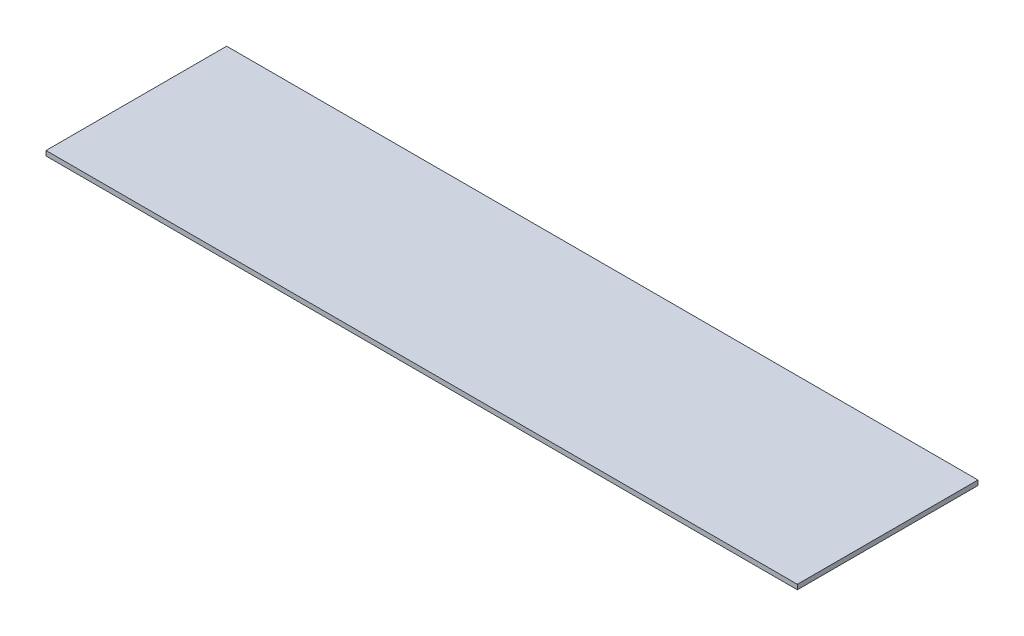
ISO-10303-21;
HEADER;
FILE_DESCRIPTION(('STEP AP214'),'2;1');
FILE_NAME('part.step','',(''),(''),'','','');
FILE_SCHEMA(('AUTOMOTIVE_DESIGN { 1 0 10303 214 1 1 1 1 }'));
ENDSEC;
DATA;
#1=APPLICATION_CONTEXT('core data for automotive mechanical design processes');
#2=APPLICATION_PROTOCOL_DEFINITION('international standard','automotive_design',2000,#1);
#3=PRODUCT_CONTEXT('',#1,'mechanical');
#4=PRODUCT('Part','Part','',(#3));
#5=PRODUCT_RELATED_PRODUCT_CATEGORY('part','',(#4));
#6=PRODUCT_DEFINITION_FORMATION('','',#4);
#7=PRODUCT_DEFINITION_CONTEXT('part definition',#1,'design');
#8=PRODUCT_DEFINITION('design','',#6,#7);
#9=PRODUCT_DEFINITION_SHAPE('','',#8);
#10=(LENGTH_UNIT() NAMED_UNIT(*) SI_UNIT(.MILLI.,.METRE.));
#11=(NAMED_UNIT(*) PLANE_ANGLE_UNIT() SI_UNIT($,.RADIAN.));
#12=(NAMED_UNIT(*) SI_UNIT($,.STERADIAN.) SOLID_ANGLE_UNIT());
#13=UNCERTAINTY_MEASURE_WITH_UNIT(LENGTH_MEASURE(1.E-05),#10,'distance_accuracy_value','');
#14=(GEOMETRIC_REPRESENTATION_CONTEXT(3) GLOBAL_UNCERTAINTY_ASSIGNED_CONTEXT((#13)) GLOBAL_UNIT_ASSIGNED_CONTEXT((#10,
#11,#12)) REPRESENTATION_CONTEXT('',''));
#15=CARTESIAN_POINT('',(0.,0.,0.));
#16=DIRECTION('',(0.,0.,1.));
#17=DIRECTION('',(1.,0.,0.));
#18=AXIS2_PLACEMENT_3D('',#15,#16,#17);
#19=CARTESIAN_POINT('',(235.,3.,56.5));
#20=DIRECTION('',(-1.,0.,0.));
#21=DIRECTION('',(0.,0.,1.));
#22=AXIS2_PLACEMENT_3D('',#19,#20,#21);
#23=PLANE('',#22);
#24=DIRECTION('',(0.,0.,-1.));
#25=VECTOR('',#24,1.);
#26=CARTESIAN_POINT('',(235.,0.,56.5));
#27=LINE('',#26,#25);
#28=CARTESIAN_POINT('',(235.,0.,56.5));
#29=VERTEX_POINT('',#28);
#30=CARTESIAN_POINT('',(235.,0.,-56.5));
#31=VERTEX_POINT('',#30);
#32=EDGE_CURVE('E97',#29,#31,#27,.T.);
#33=ORIENTED_EDGE('',*,*,#32,.T.);
#34=DIRECTION('',(0.,-1.,0.));
#35=VECTOR('',#34,1.);
#36=CARTESIAN_POINT('',(235.,3.,-56.5));
#37=LINE('',#36,#35);
#38=CARTESIAN_POINT('',(235.,3.,-56.5));
#39=VERTEX_POINT('',#38);
#40=EDGE_CURVE('E11',#39,#31,#37,.T.);
#41=ORIENTED_EDGE('',*,*,#40,.F.);
#42=DIRECTION('',(0.,0.,-1.));
#43=VECTOR('',#42,1.);
#44=CARTESIAN_POINT('',(235.,3.,56.5));
#45=LINE('',#44,#43);
#46=CARTESIAN_POINT('',(235.,3.,56.5));
#47=VERTEX_POINT('',#46);
#48=EDGE_CURVE('E85',#47,#39,#45,.T.);
#49=ORIENTED_EDGE('',*,*,#48,.F.);
#50=DIRECTION('',(0.,-1.,0.));
#51=VECTOR('',#50,1.);
#52=CARTESIAN_POINT('',(235.,3.,56.5));
#53=LINE('',#52,#51);
#54=EDGE_CURVE('E93',#47,#29,#53,.T.);
#55=ORIENTED_EDGE('',*,*,#54,.T.);
#56=EDGE_LOOP('',(#33,#41,#49,#55));
#57=FACE_BOUND('',#56,.T.);
#58=ADVANCED_FACE('F34',(#57),#23,.F.);
#59=CARTESIAN_POINT('',(-235.,3.,-56.5));
#60=DIRECTION('',(0.,0.,1.));
#61=DIRECTION('',(1.,0.,0.));
#62=AXIS2_PLACEMENT_3D('',#59,#60,#61);
#63=PLANE('',#62);
#64=DIRECTION('',(-1.,0.,0.));
#65=VECTOR('',#64,1.);
#66=CARTESIAN_POINT('',(-235.,0.,-56.5));
#67=LINE('',#66,#65);
#68=CARTESIAN_POINT('',(-235.,0.,-56.5));
#69=VERTEX_POINT('',#68);
#70=EDGE_CURVE('E89',#31,#69,#67,.T.);
#71=ORIENTED_EDGE('',*,*,#70,.T.);
#72=DIRECTION('',(0.,-1.,0.));
#73=VECTOR('',#72,1.);
#74=CARTESIAN_POINT('',(-235.,3.,-56.5));
#75=LINE('',#74,#73);
#76=CARTESIAN_POINT('',(-235.,3.,-56.5));
#77=VERTEX_POINT('',#76);
#78=EDGE_CURVE('E42',#77,#69,#75,.T.);
#79=ORIENTED_EDGE('',*,*,#78,.F.);
#80=DIRECTION('',(-1.,0.,0.));
#81=VECTOR('',#80,1.);
#82=CARTESIAN_POINT('',(-235.,3.,-56.5));
#83=LINE('',#82,#81);
#84=EDGE_CURVE('E80',#39,#77,#83,.T.);
#85=ORIENTED_EDGE('',*,*,#84,.F.);
#86=ORIENTED_EDGE('',*,*,#40,.T.);
#87=EDGE_LOOP('',(#71,#79,#85,#86));
#88=FACE_BOUND('',#87,.T.);
#89=ADVANCED_FACE('F88',(#88),#63,.F.);
#90=CARTESIAN_POINT('',(-235.,3.,56.5));
#91=DIRECTION('',(1.,0.,0.));
#92=DIRECTION('',(0.,0.,-1.));
#93=AXIS2_PLACEMENT_3D('',#90,#91,#92);
#94=PLANE('',#93);
#95=DIRECTION('',(0.,0.,1.));
#96=VECTOR('',#95,1.);
#97=CARTESIAN_POINT('',(-235.,0.,56.5));
#98=LINE('',#97,#96);
#99=CARTESIAN_POINT('',(-235.,0.,56.5));
#100=VERTEX_POINT('',#99);
#101=EDGE_CURVE('E67',#69,#100,#98,.T.);
#102=ORIENTED_EDGE('',*,*,#101,.T.);
#103=DIRECTION('',(0.,-1.,0.));
#104=VECTOR('',#103,1.);
#105=CARTESIAN_POINT('',(-235.,3.,56.5));
#106=LINE('',#105,#104);
#107=CARTESIAN_POINT('',(-235.,3.,56.5));
#108=VERTEX_POINT('',#107);
#109=EDGE_CURVE('E90',#108,#100,#106,.T.);
#110=ORIENTED_EDGE('',*,*,#109,.F.);
#111=DIRECTION('',(0.,0.,1.));
#112=VECTOR('',#111,1.);
#113=CARTESIAN_POINT('',(-235.,3.,56.5));
#114=LINE('',#113,#112);
#115=EDGE_CURVE('E83',#77,#108,#114,.T.);
#116=ORIENTED_EDGE('',*,*,#115,.F.);
#117=ORIENTED_EDGE('',*,*,#78,.T.);
#118=EDGE_LOOP('',(#102,#110,#116,#117));
#119=FACE_BOUND('',#118,.T.);
#120=ADVANCED_FACE('F91',(#119),#94,.F.);
#121=CARTESIAN_POINT('',(-235.,3.,56.5));
#122=DIRECTION('',(0.,0.,-1.));
#123=DIRECTION('',(-1.,0.,0.));
#124=AXIS2_PLACEMENT_3D('',#121,#122,#123);
#125=PLANE('',#124);
#126=DIRECTION('',(1.,0.,0.));
#127=VECTOR('',#126,1.);
#128=CARTESIAN_POINT('',(-235.,0.,56.5));
#129=LINE('',#128,#127);
#130=EDGE_CURVE('E73',#100,#29,#129,.T.);
#131=ORIENTED_EDGE('',*,*,#130,.T.);
#132=ORIENTED_EDGE('',*,*,#54,.F.);
#133=DIRECTION('',(1.,0.,0.));
#134=VECTOR('',#133,1.);
#135=CARTESIAN_POINT('',(-235.,3.,56.5));
#136=LINE('',#135,#134);
#137=EDGE_CURVE('E50',#108,#47,#136,.T.);
#138=ORIENTED_EDGE('',*,*,#137,.F.);
#139=ORIENTED_EDGE('',*,*,#109,.T.);
#140=EDGE_LOOP('',(#131,#132,#138,#139));
#141=FACE_BOUND('',#140,.T.);
#142=ADVANCED_FACE('F104',(#141),#125,.F.);
#143=CARTESIAN_POINT('',(0.,3.,0.));
#144=DIRECTION('',(0.,-1.,0.));
#145=DIRECTION('',(0.,0.,-1.));
#146=AXIS2_PLACEMENT_3D('',#143,#144,#145);
#147=PLANE('',#146);
#148=ORIENTED_EDGE('',*,*,#48,.T.);
#149=ORIENTED_EDGE('',*,*,#84,.T.);
#150=ORIENTED_EDGE('',*,*,#115,.T.);
#151=ORIENTED_EDGE('',*,*,#137,.T.);
#152=EDGE_LOOP('',(#148,#149,#150,#151));
#153=FACE_BOUND('',#152,.T.);
#154=ADVANCED_FACE('F81',(#153),#147,.F.);
#155=CARTESIAN_POINT('',(0.,0.,0.));
#156=DIRECTION('',(0.,-1.,0.));
#157=DIRECTION('',(0.,0.,-1.));
#158=AXIS2_PLACEMENT_3D('',#155,#156,#157);
#159=PLANE('',#158);
#160=ORIENTED_EDGE('',*,*,#32,.F.);
#161=ORIENTED_EDGE('',*,*,#130,.F.);
#162=ORIENTED_EDGE('',*,*,#101,.F.);
#163=ORIENTED_EDGE('',*,*,#70,.F.);
#164=EDGE_LOOP('',(#160,#161,#162,#163));
#165=FACE_BOUND('',#164,.T.);
#166=ADVANCED_FACE('F107',(#165),#159,.T.);
#167=CLOSED_SHELL('',(#58,#89,#120,#142,#154,#166));
#168=MANIFOLD_SOLID_BREP('B2',#167);
#169=ADVANCED_BREP_SHAPE_REPRESENTATION('',(#18,#168),#14);
#170=SHAPE_DEFINITION_REPRESENTATION(#9,#169);
ENDSEC;
END-ISO-10303-21;
